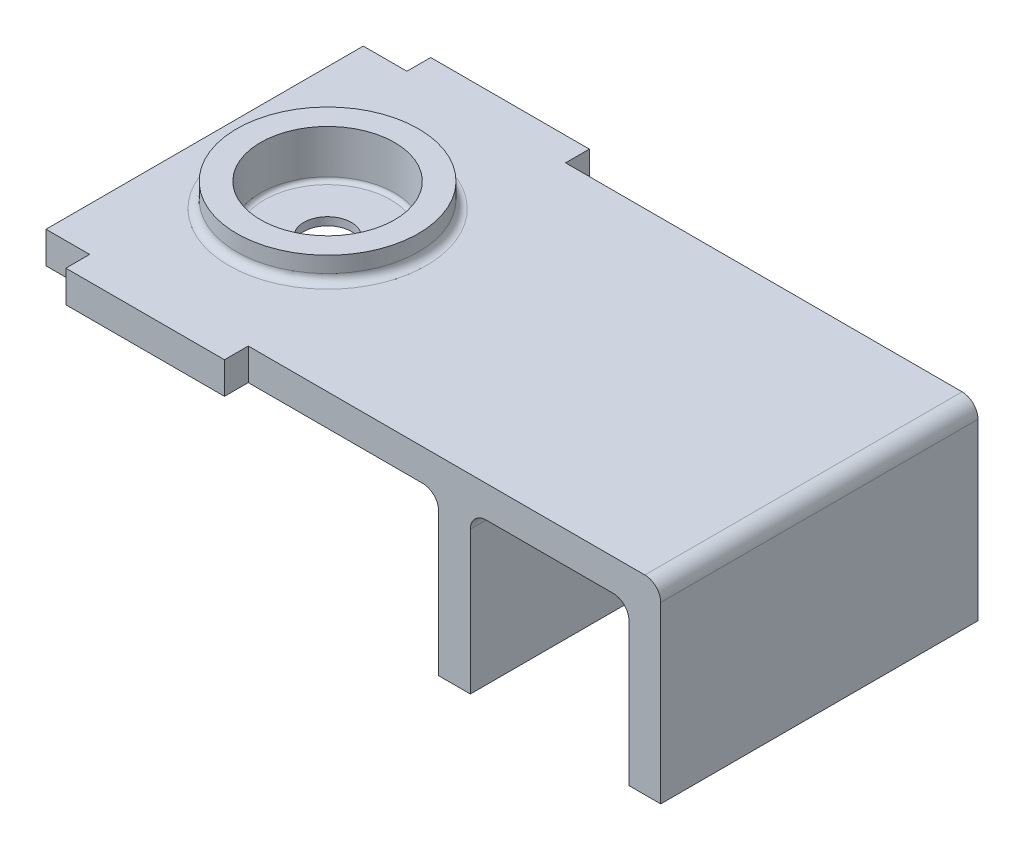
ISO-10303-21;
HEADER;
FILE_DESCRIPTION(('STEP AP214'),'2;1');
FILE_NAME('part.step','',(''),(''),'','','');
FILE_SCHEMA(('AUTOMOTIVE_DESIGN { 1 0 10303 214 1 1 1 1 }'));
ENDSEC;
DATA;
#1=APPLICATION_CONTEXT('core data for automotive mechanical design processes');
#2=APPLICATION_PROTOCOL_DEFINITION('international standard','automotive_design',2000,#1);
#3=PRODUCT_CONTEXT('',#1,'mechanical');
#4=PRODUCT('Part','Part','',(#3));
#5=PRODUCT_RELATED_PRODUCT_CATEGORY('part','',(#4));
#6=PRODUCT_DEFINITION_FORMATION('','',#4);
#7=PRODUCT_DEFINITION_CONTEXT('part definition',#1,'design');
#8=PRODUCT_DEFINITION('design','',#6,#7);
#9=PRODUCT_DEFINITION_SHAPE('','',#8);
#10=(LENGTH_UNIT() NAMED_UNIT(*) SI_UNIT(.MILLI.,.METRE.));
#11=(NAMED_UNIT(*) PLANE_ANGLE_UNIT() SI_UNIT($,.RADIAN.));
#12=(NAMED_UNIT(*) SI_UNIT($,.STERADIAN.) SOLID_ANGLE_UNIT());
#13=UNCERTAINTY_MEASURE_WITH_UNIT(LENGTH_MEASURE(1.E-05),#10,'distance_accuracy_value','');
#14=(GEOMETRIC_REPRESENTATION_CONTEXT(3) GLOBAL_UNCERTAINTY_ASSIGNED_CONTEXT((#13)) GLOBAL_UNIT_ASSIGNED_CONTEXT((#10,
#11,#12)) REPRESENTATION_CONTEXT('',''));
#15=CARTESIAN_POINT('',(0.,0.,0.));
#16=DIRECTION('',(0.,0.,1.));
#17=DIRECTION('',(1.,0.,0.));
#18=AXIS2_PLACEMENT_3D('',#15,#16,#17);
#19=CARTESIAN_POINT('',(0.,11.,20.));
#20=DIRECTION('',(0.,0.,1.));
#21=DIRECTION('',(1.,0.,0.));
#22=AXIS2_PLACEMENT_3D('',#19,#20,#21);
#23=PLANE('',#22);
#24=DIRECTION('',(0.,1.,0.));
#25=VECTOR('',#24,1.);
#26=CARTESIAN_POINT('',(-58.,11.,20.));
#27=LINE('',#26,#25);
#28=CARTESIAN_POINT('',(-58.,10.,20.));
#29=VERTEX_POINT('',#28);
#30=CARTESIAN_POINT('',(-58.,14.,20.));
#31=VERTEX_POINT('',#30);
#32=EDGE_CURVE('E226',#29,#31,#27,.T.);
#33=ORIENTED_EDGE('',*,*,#32,.F.);
#34=DIRECTION('',(-1.,0.,0.));
#35=VECTOR('',#34,1.);
#36=CARTESIAN_POINT('',(0.,10.,20.));
#37=LINE('',#36,#35);
#38=CARTESIAN_POINT('',(-63.5,10.,20.));
#39=VERTEX_POINT('',#38);
#40=EDGE_CURVE('E371',#29,#39,#37,.T.);
#41=ORIENTED_EDGE('',*,*,#40,.T.);
#42=DIRECTION('',(0.,-1.,0.));
#43=VECTOR('',#42,1.);
#44=CARTESIAN_POINT('',(-63.5,11.,20.));
#45=LINE('',#44,#43);
#46=CARTESIAN_POINT('',(-63.5,14.,20.));
#47=VERTEX_POINT('',#46);
#48=EDGE_CURVE('E384',#47,#39,#45,.T.);
#49=ORIENTED_EDGE('',*,*,#48,.F.);
#50=DIRECTION('',(1.,0.,0.));
#51=VECTOR('',#50,1.);
#52=CARTESIAN_POINT('',(0.,14.,20.));
#53=LINE('',#52,#51);
#54=EDGE_CURVE('E348',#47,#31,#53,.T.);
#55=ORIENTED_EDGE('',*,*,#54,.T.);
#56=EDGE_LOOP('',(#33,#41,#49,#55));
#57=FACE_BOUND('',#56,.T.);
#58=ADVANCED_FACE('F42',(#57),#23,.F.);
#59=CARTESIAN_POINT('',(-38.,14.,20.));
#60=VERTEX_POINT('',#59);
#61=CARTESIAN_POINT('',(12.,14.,20.));
#62=VERTEX_POINT('',#61);
#63=EDGE_CURVE('E347',#60,#62,#53,.T.);
#64=ORIENTED_EDGE('',*,*,#63,.T.);
#65=CARTESIAN_POINT('',(12.,12.,20.));
#66=DIRECTION('',(0.,0.,1.));
#67=DIRECTION('',(1.,0.,0.));
#68=AXIS2_PLACEMENT_3D('',#65,#66,#67);
#69=CIRCLE('',#68,2.);
#70=CARTESIAN_POINT('',(14.,12.,20.));
#71=VERTEX_POINT('',#70);
#72=EDGE_CURVE('E443',#62,#71,#69,.F.);
#73=ORIENTED_EDGE('',*,*,#72,.T.);
#74=DIRECTION('',(0.,1.,0.));
#75=VECTOR('',#74,1.);
#76=CARTESIAN_POINT('',(14.,-50.1995024844836,20.));
#77=LINE('',#76,#75);
#78=CARTESIAN_POINT('',(14.,-9.99999999999999,20.));
#79=VERTEX_POINT('',#78);
#80=EDGE_CURVE('E298',#79,#71,#77,.T.);
#81=ORIENTED_EDGE('',*,*,#80,.F.);
#82=DIRECTION('',(-1.,0.,0.));
#83=VECTOR('',#82,1.);
#84=CARTESIAN_POINT('',(0.,-9.99999999999999,20.));
#85=LINE('',#84,#83);
#86=CARTESIAN_POINT('',(10.,-9.99999999999999,20.));
#87=VERTEX_POINT('',#86);
#88=EDGE_CURVE('E277',#79,#87,#85,.T.);
#89=ORIENTED_EDGE('',*,*,#88,.T.);
#90=DIRECTION('',(0.,1.,0.));
#91=VECTOR('',#90,1.);
#92=CARTESIAN_POINT('',(10.,-50.1995024844836,20.));
#93=LINE('',#92,#91);
#94=CARTESIAN_POINT('',(10.,8.,20.));
#95=VERTEX_POINT('',#94);
#96=EDGE_CURVE('E294',#87,#95,#93,.T.);
#97=ORIENTED_EDGE('',*,*,#96,.T.);
#98=CARTESIAN_POINT('',(8.00000000000001,8.,20.));
#99=DIRECTION('',(0.,0.,1.));
#100=DIRECTION('',(1.,0.,0.));
#101=AXIS2_PLACEMENT_3D('',#98,#99,#100);
#102=CIRCLE('',#101,2.);
#103=CARTESIAN_POINT('',(8.00000000000001,10.,20.));
#104=VERTEX_POINT('',#103);
#105=EDGE_CURVE('E429',#95,#104,#102,.T.);
#106=ORIENTED_EDGE('',*,*,#105,.T.);
#107=CARTESIAN_POINT('',(-7.99999999999999,10.,20.));
#108=VERTEX_POINT('',#107);
#109=EDGE_CURVE('E373',#104,#108,#37,.T.);
#110=ORIENTED_EDGE('',*,*,#109,.T.);
#111=CARTESIAN_POINT('',(-7.99999999999999,8.,20.));
#112=DIRECTION('',(0.,0.,1.));
#113=DIRECTION('',(1.,0.,0.));
#114=AXIS2_PLACEMENT_3D('',#111,#112,#113);
#115=CIRCLE('',#114,2.);
#116=CARTESIAN_POINT('',(-9.99999999999999,8.,20.));
#117=VERTEX_POINT('',#116);
#118=EDGE_CURVE('E426',#108,#117,#115,.T.);
#119=ORIENTED_EDGE('',*,*,#118,.T.);
#120=DIRECTION('',(0.,1.,0.));
#121=VECTOR('',#120,1.);
#122=CARTESIAN_POINT('',(-9.99999999999999,-50.1995024844836,20.));
#123=LINE('',#122,#121);
#124=CARTESIAN_POINT('',(-9.99999999999999,-9.99999999999999,20.));
#125=VERTEX_POINT('',#124);
#126=EDGE_CURVE('E289',#125,#117,#123,.T.);
#127=ORIENTED_EDGE('',*,*,#126,.F.);
#128=DIRECTION('',(1.,0.,0.));
#129=VECTOR('',#128,1.);
#130=CARTESIAN_POINT('',(0.,-9.99999999999999,20.));
#131=LINE('',#130,#129);
#132=CARTESIAN_POINT('',(-14.,-9.99999999999999,20.));
#133=VERTEX_POINT('',#132);
#134=EDGE_CURVE('E318',#133,#125,#131,.T.);
#135=ORIENTED_EDGE('',*,*,#134,.F.);
#136=DIRECTION('',(0.,1.,0.));
#137=VECTOR('',#136,1.);
#138=CARTESIAN_POINT('',(-14.,-50.1995024844836,20.));
#139=LINE('',#138,#137);
#140=CARTESIAN_POINT('',(-14.,8.,20.));
#141=VERTEX_POINT('',#140);
#142=EDGE_CURVE('E322',#133,#141,#139,.T.);
#143=ORIENTED_EDGE('',*,*,#142,.T.);
#144=CARTESIAN_POINT('',(-16.,8.,20.));
#145=DIRECTION('',(0.,0.,1.));
#146=DIRECTION('',(1.,0.,0.));
#147=AXIS2_PLACEMENT_3D('',#144,#145,#146);
#148=CIRCLE('',#147,2.);
#149=CARTESIAN_POINT('',(-16.,10.,20.));
#150=VERTEX_POINT('',#149);
#151=EDGE_CURVE('E420',#141,#150,#148,.T.);
#152=ORIENTED_EDGE('',*,*,#151,.T.);
#153=CARTESIAN_POINT('',(-38.,10.,20.));
#154=VERTEX_POINT('',#153);
#155=EDGE_CURVE('E377',#150,#154,#37,.T.);
#156=ORIENTED_EDGE('',*,*,#155,.T.);
#157=DIRECTION('',(0.,-1.,0.));
#158=VECTOR('',#157,1.);
#159=CARTESIAN_POINT('',(-38.,11.,20.));
#160=LINE('',#159,#158);
#161=EDGE_CURVE('E211',#60,#154,#160,.T.);
#162=ORIENTED_EDGE('',*,*,#161,.F.);
#163=EDGE_LOOP('',(#64,#73,#81,#89,#97,#106,#110,#119,#127,#135,#143,#152,#156,#162));
#164=FACE_BOUND('',#163,.T.);
#165=ADVANCED_FACE('F462',(#164),#23,.F.);
#166=CARTESIAN_POINT('',(0.,11.,60.));
#167=DIRECTION('',(0.,0.,1.));
#168=DIRECTION('',(1.,0.,0.));
#169=AXIS2_PLACEMENT_3D('',#166,#167,#168);
#170=PLANE('',#169);
#171=DIRECTION('',(0.,1.,0.));
#172=VECTOR('',#171,1.);
#173=CARTESIAN_POINT('',(14.,-50.1995024844836,60.));
#174=LINE('',#173,#172);
#175=CARTESIAN_POINT('',(14.,-9.99999999999999,60.));
#176=VERTEX_POINT('',#175);
#177=CARTESIAN_POINT('',(14.,12.,60.));
#178=VERTEX_POINT('',#177);
#179=EDGE_CURVE('E267',#176,#178,#174,.T.);
#180=ORIENTED_EDGE('',*,*,#179,.T.);
#181=CARTESIAN_POINT('',(12.,12.,60.));
#182=DIRECTION('',(0.,0.,1.));
#183=DIRECTION('',(1.,0.,0.));
#184=AXIS2_PLACEMENT_3D('',#181,#182,#183);
#185=CIRCLE('',#184,2.);
#186=CARTESIAN_POINT('',(12.,14.,60.));
#187=VERTEX_POINT('',#186);
#188=EDGE_CURVE('E66',#178,#187,#185,.T.);
#189=ORIENTED_EDGE('',*,*,#188,.T.);
#190=DIRECTION('',(1.,0.,0.));
#191=VECTOR('',#190,1.);
#192=CARTESIAN_POINT('',(0.,14.,60.));
#193=LINE('',#192,#191);
#194=CARTESIAN_POINT('',(-38.,14.,60.));
#195=VERTEX_POINT('',#194);
#196=EDGE_CURVE('E351',#195,#187,#193,.T.);
#197=ORIENTED_EDGE('',*,*,#196,.F.);
#198=DIRECTION('',(0.,-1.,0.));
#199=VECTOR('',#198,1.);
#200=CARTESIAN_POINT('',(-38.,0.,60.));
#201=LINE('',#200,#199);
#202=CARTESIAN_POINT('',(-38.,10.,60.));
#203=VERTEX_POINT('',#202);
#204=EDGE_CURVE('E245',#195,#203,#201,.T.);
#205=ORIENTED_EDGE('',*,*,#204,.T.);
#206=DIRECTION('',(-1.,0.,0.));
#207=VECTOR('',#206,1.);
#208=CARTESIAN_POINT('',(0.,10.,60.));
#209=LINE('',#208,#207);
#210=CARTESIAN_POINT('',(-16.,10.,60.));
#211=VERTEX_POINT('',#210);
#212=EDGE_CURVE('E372',#211,#203,#209,.T.);
#213=ORIENTED_EDGE('',*,*,#212,.F.);
#214=CARTESIAN_POINT('',(-16.,8.,60.));
#215=DIRECTION('',(0.,0.,1.));
#216=DIRECTION('',(1.,0.,0.));
#217=AXIS2_PLACEMENT_3D('',#214,#215,#216);
#218=CIRCLE('',#217,2.);
#219=CARTESIAN_POINT('',(-14.,8.,60.));
#220=VERTEX_POINT('',#219);
#221=EDGE_CURVE('E417',#211,#220,#218,.F.);
#222=ORIENTED_EDGE('',*,*,#221,.T.);
#223=DIRECTION('',(0.,1.,0.));
#224=VECTOR('',#223,1.);
#225=CARTESIAN_POINT('',(-14.,-50.1995024844836,60.));
#226=LINE('',#225,#224);
#227=CARTESIAN_POINT('',(-14.,-9.99999999999999,60.));
#228=VERTEX_POINT('',#227);
#229=EDGE_CURVE('E326',#228,#220,#226,.T.);
#230=ORIENTED_EDGE('',*,*,#229,.F.);
#231=DIRECTION('',(-1.,0.,0.));
#232=VECTOR('',#231,1.);
#233=CARTESIAN_POINT('',(0.,-9.99999999999999,60.));
#234=LINE('',#233,#232);
#235=CARTESIAN_POINT('',(-9.99999999999999,-9.99999999999999,60.));
#236=VERTEX_POINT('',#235);
#237=EDGE_CURVE('E310',#236,#228,#234,.T.);
#238=ORIENTED_EDGE('',*,*,#237,.F.);
#239=DIRECTION('',(0.,1.,0.));
#240=VECTOR('',#239,1.);
#241=CARTESIAN_POINT('',(-9.99999999999999,-50.1995024844836,60.));
#242=LINE('',#241,#240);
#243=CARTESIAN_POINT('',(-9.99999999999999,8.,60.));
#244=VERTEX_POINT('',#243);
#245=EDGE_CURVE('E311',#236,#244,#242,.T.);
#246=ORIENTED_EDGE('',*,*,#245,.T.);
#247=CARTESIAN_POINT('',(-7.99999999999999,8.,60.));
#248=DIRECTION('',(0.,0.,1.));
#249=DIRECTION('',(1.,0.,0.));
#250=AXIS2_PLACEMENT_3D('',#247,#248,#249);
#251=CIRCLE('',#250,2.);
#252=CARTESIAN_POINT('',(-7.99999999999999,10.,60.));
#253=VERTEX_POINT('',#252);
#254=EDGE_CURVE('E423',#244,#253,#251,.F.);
#255=ORIENTED_EDGE('',*,*,#254,.T.);
#256=CARTESIAN_POINT('',(8.00000000000001,10.,60.));
#257=VERTEX_POINT('',#256);
#258=EDGE_CURVE('E367',#257,#253,#209,.T.);
#259=ORIENTED_EDGE('',*,*,#258,.F.);
#260=CARTESIAN_POINT('',(8.00000000000001,8.,60.));
#261=DIRECTION('',(0.,0.,1.));
#262=DIRECTION('',(1.,0.,0.));
#263=AXIS2_PLACEMENT_3D('',#260,#261,#262);
#264=CIRCLE('',#263,2.);
#265=CARTESIAN_POINT('',(10.,8.,60.));
#266=VERTEX_POINT('',#265);
#267=EDGE_CURVE('E432',#257,#266,#264,.F.);
#268=ORIENTED_EDGE('',*,*,#267,.T.);
#269=DIRECTION('',(0.,1.,0.));
#270=VECTOR('',#269,1.);
#271=CARTESIAN_POINT('',(10.,-50.1995024844836,60.));
#272=LINE('',#271,#270);
#273=CARTESIAN_POINT('',(10.,-9.99999999999999,60.));
#274=VERTEX_POINT('',#273);
#275=EDGE_CURVE('E290',#274,#266,#272,.T.);
#276=ORIENTED_EDGE('',*,*,#275,.F.);
#277=DIRECTION('',(-1.,0.,0.));
#278=VECTOR('',#277,1.);
#279=CARTESIAN_POINT('',(0.,-9.99999999999999,60.));
#280=LINE('',#279,#278);
#281=EDGE_CURVE('E286',#176,#274,#280,.T.);
#282=ORIENTED_EDGE('',*,*,#281,.F.);
#283=EDGE_LOOP('',(#180,#189,#197,#205,#213,#222,#230,#238,#246,#255,#259,#268,#276,#282));
#284=FACE_BOUND('',#283,.T.);
#285=ADVANCED_FACE('F468',(#284),#170,.T.);
#286=CARTESIAN_POINT('',(-58.,10.,60.));
#287=VERTEX_POINT('',#286);
#288=CARTESIAN_POINT('',(-63.5,10.,60.));
#289=VERTEX_POINT('',#288);
#290=EDGE_CURVE('E366',#287,#289,#209,.T.);
#291=ORIENTED_EDGE('',*,*,#290,.F.);
#292=DIRECTION('',(0.,1.,0.));
#293=VECTOR('',#292,1.);
#294=CARTESIAN_POINT('',(-58.,0.,60.));
#295=LINE('',#294,#293);
#296=CARTESIAN_POINT('',(-58.,14.,60.));
#297=VERTEX_POINT('',#296);
#298=EDGE_CURVE('E240',#287,#297,#295,.T.);
#299=ORIENTED_EDGE('',*,*,#298,.T.);
#300=CARTESIAN_POINT('',(-63.5,14.,60.));
#301=VERTEX_POINT('',#300);
#302=EDGE_CURVE('E352',#301,#297,#193,.T.);
#303=ORIENTED_EDGE('',*,*,#302,.F.);
#304=DIRECTION('',(0.,-1.,0.));
#305=VECTOR('',#304,1.);
#306=CARTESIAN_POINT('',(-63.5,11.,60.));
#307=LINE('',#306,#305);
#308=EDGE_CURVE('E361',#301,#289,#307,.T.);
#309=ORIENTED_EDGE('',*,*,#308,.T.);
#310=EDGE_LOOP('',(#291,#299,#303,#309));
#311=FACE_BOUND('',#310,.T.);
#312=ADVANCED_FACE('F476',(#311),#170,.T.);
#313=CARTESIAN_POINT('',(0.,10.,0.));
#314=DIRECTION('',(0.,1.,0.));
#315=DIRECTION('',(0.,0.,1.));
#316=AXIS2_PLACEMENT_3D('',#313,#314,#315);
#317=PLANE('',#316);
#318=ORIENTED_EDGE('',*,*,#258,.T.);
#319=DIRECTION('',(0.,0.,1.));
#320=VECTOR('',#319,1.);
#321=CARTESIAN_POINT('',(-7.99999999999999,10.,20.));
#322=LINE('',#321,#320);
#323=EDGE_CURVE('E410',#253,#108,#322,.F.);
#324=ORIENTED_EDGE('',*,*,#323,.T.);
#325=ORIENTED_EDGE('',*,*,#109,.F.);
#326=DIRECTION('',(0.,0.,-1.));
#327=VECTOR('',#326,1.);
#328=CARTESIAN_POINT('',(8.00000000000001,10.,60.));
#329=LINE('',#328,#327);
#330=EDGE_CURVE('E407',#104,#257,#329,.F.);
#331=ORIENTED_EDGE('',*,*,#330,.T.);
#332=EDGE_LOOP('',(#318,#324,#325,#331));
#333=FACE_BOUND('',#332,.T.);
#334=ADVANCED_FACE('F547',(#333),#317,.F.);
#335=CARTESIAN_POINT('',(0.,11.,0.));
#336=DIRECTION('',(0.,1.,0.));
#337=DIRECTION('',(0.,0.,1.));
#338=AXIS2_PLACEMENT_3D('',#335,#336,#337);
#339=PLANE('',#338);
#340=CARTESIAN_POINT('',(-48.,11.,40.));
#341=DIRECTION('',(0.,1.,0.));
#342=DIRECTION('',(0.,0.,1.));
#343=AXIS2_PLACEMENT_3D('',#340,#341,#342);
#344=CIRCLE('',#343,7.95);
#345=CARTESIAN_POINT('',(-48.,11.,47.95));
#346=VERTEX_POINT('',#345);
#347=EDGE_CURVE('E51',#346,#346,#344,.T.);
#348=ORIENTED_EDGE('',*,*,#347,.T.);
#349=EDGE_LOOP('',(#348));
#350=FACE_BOUND('',#349,.T.);
#351=CARTESIAN_POINT('',(-48.,11.,40.));
#352=DIRECTION('',(0.,1.,0.));
#353=DIRECTION('',(0.,0.,1.));
#354=AXIS2_PLACEMENT_3D('',#351,#352,#353);
#355=CIRCLE('',#354,3.);
#356=CARTESIAN_POINT('',(-48.,11.,43.));
#357=VERTEX_POINT('',#356);
#358=EDGE_CURVE('E357',#357,#357,#355,.T.);
#359=ORIENTED_EDGE('',*,*,#358,.F.);
#360=EDGE_LOOP('',(#359));
#361=FACE_BOUND('',#360,.T.);
#362=ADVANCED_FACE('F449',(#350,#361),#339,.T.);
#363=CARTESIAN_POINT('',(-48.,11.,40.));
#364=DIRECTION('',(0.,-1.,0.));
#365=DIRECTION('',(0.,0.,-1.));
#366=AXIS2_PLACEMENT_3D('',#363,#364,#365);
#367=CYLINDRICAL_SURFACE('',#366,3.);
#368=ORIENTED_EDGE('',*,*,#358,.T.);
#369=EDGE_LOOP('',(#368));
#370=FACE_BOUND('',#369,.T.);
#371=CARTESIAN_POINT('',(-48.,10.,40.));
#372=DIRECTION('',(0.,1.,0.));
#373=DIRECTION('',(0.,0.,1.));
#374=AXIS2_PLACEMENT_3D('',#371,#372,#373);
#375=CIRCLE('',#374,3.);
#376=CARTESIAN_POINT('',(-48.,10.,43.));
#377=VERTEX_POINT('',#376);
#378=EDGE_CURVE('E356',#377,#377,#375,.T.);
#379=ORIENTED_EDGE('',*,*,#378,.F.);
#380=EDGE_LOOP('',(#379));
#381=FACE_BOUND('',#380,.T.);
#382=ADVANCED_FACE('F477',(#370,#381),#367,.F.);
#383=CARTESIAN_POINT('',(-63.5,11.,0.));
#384=DIRECTION('',(1.,0.,0.));
#385=DIRECTION('',(0.,0.,-1.));
#386=AXIS2_PLACEMENT_3D('',#383,#384,#385);
#387=PLANE('',#386);
#388=DIRECTION('',(0.,0.,1.));
#389=VECTOR('',#388,1.);
#390=CARTESIAN_POINT('',(-63.5,10.,0.));
#391=LINE('',#390,#389);
#392=EDGE_CURVE('E362',#39,#289,#391,.T.);
#393=ORIENTED_EDGE('',*,*,#392,.T.);
#394=ORIENTED_EDGE('',*,*,#308,.F.);
#395=DIRECTION('',(0.,0.,-1.));
#396=VECTOR('',#395,1.);
#397=CARTESIAN_POINT('',(-63.5,14.,0.));
#398=LINE('',#397,#396);
#399=EDGE_CURVE('E343',#301,#47,#398,.T.);
#400=ORIENTED_EDGE('',*,*,#399,.T.);
#401=ORIENTED_EDGE('',*,*,#48,.T.);
#402=EDGE_LOOP('',(#393,#394,#400,#401));
#403=FACE_BOUND('',#402,.T.);
#404=ADVANCED_FACE('F472',(#403),#387,.F.);
#405=ORIENTED_EDGE('',*,*,#378,.T.);
#406=EDGE_LOOP('',(#405));
#407=FACE_BOUND('',#406,.T.);
#408=ORIENTED_EDGE('',*,*,#155,.F.);
#409=DIRECTION('',(0.,0.,1.));
#410=VECTOR('',#409,1.);
#411=CARTESIAN_POINT('',(-16.,10.,0.));
#412=LINE('',#411,#410);
#413=EDGE_CURVE('E396',#150,#211,#412,.T.);
#414=ORIENTED_EDGE('',*,*,#413,.T.);
#415=ORIENTED_EDGE('',*,*,#212,.T.);
#416=DIRECTION('',(0.,0.,-1.));
#417=VECTOR('',#416,1.);
#418=CARTESIAN_POINT('',(-38.,10.,83.3960780543712));
#419=LINE('',#418,#417);
#420=CARTESIAN_POINT('',(-38.,10.,63.));
#421=VERTEX_POINT('',#420);
#422=EDGE_CURVE('E263',#421,#203,#419,.T.);
#423=ORIENTED_EDGE('',*,*,#422,.F.);
#424=DIRECTION('',(1.,0.,0.));
#425=VECTOR('',#424,1.);
#426=CARTESIAN_POINT('',(0.,10.,63.));
#427=LINE('',#426,#425);
#428=CARTESIAN_POINT('',(-58.,10.,63.));
#429=VERTEX_POINT('',#428);
#430=EDGE_CURVE('E258',#429,#421,#427,.T.);
#431=ORIENTED_EDGE('',*,*,#430,.F.);
#432=DIRECTION('',(0.,0.,-1.));
#433=VECTOR('',#432,1.);
#434=CARTESIAN_POINT('',(-58.,10.,83.3960780543712));
#435=LINE('',#434,#433);
#436=EDGE_CURVE('E249',#429,#287,#435,.T.);
#437=ORIENTED_EDGE('',*,*,#436,.T.);
#438=ORIENTED_EDGE('',*,*,#290,.T.);
#439=ORIENTED_EDGE('',*,*,#392,.F.);
#440=ORIENTED_EDGE('',*,*,#40,.F.);
#441=DIRECTION('',(0.,0.,1.));
#442=VECTOR('',#441,1.);
#443=CARTESIAN_POINT('',(-58.,10.,-3.39607805437116));
#444=LINE('',#443,#442);
#445=CARTESIAN_POINT('',(-58.,10.,17.));
#446=VERTEX_POINT('',#445);
#447=EDGE_CURVE('E221',#446,#29,#444,.T.);
#448=ORIENTED_EDGE('',*,*,#447,.F.);
#449=DIRECTION('',(1.,0.,0.));
#450=VECTOR('',#449,1.);
#451=CARTESIAN_POINT('',(0.,10.,17.));
#452=LINE('',#451,#450);
#453=CARTESIAN_POINT('',(-38.,10.,17.));
#454=VERTEX_POINT('',#453);
#455=EDGE_CURVE('E197',#446,#454,#452,.T.);
#456=ORIENTED_EDGE('',*,*,#455,.T.);
#457=DIRECTION('',(0.,0.,1.));
#458=VECTOR('',#457,1.);
#459=CARTESIAN_POINT('',(-38.,10.,-3.39607805437116));
#460=LINE('',#459,#458);
#461=EDGE_CURVE('E209',#454,#154,#460,.T.);
#462=ORIENTED_EDGE('',*,*,#461,.T.);
#463=EDGE_LOOP('',(#408,#414,#415,#423,#431,#437,#438,#439,#440,#448,#456,#462));
#464=FACE_BOUND('',#463,.T.);
#465=ADVANCED_FACE('F218',(#407,#464),#317,.F.);
#466=CARTESIAN_POINT('',(0.,14.,0.));
#467=DIRECTION('',(0.,-1.,0.));
#468=DIRECTION('',(0.,0.,-1.));
#469=AXIS2_PLACEMENT_3D('',#466,#467,#468);
#470=PLANE('',#469);
#471=CARTESIAN_POINT('',(-48.,14.,40.));
#472=DIRECTION('',(0.,-1.,0.));
#473=DIRECTION('',(0.,0.,-1.));
#474=AXIS2_PLACEMENT_3D('',#471,#472,#473);
#475=CIRCLE('',#474,12.45);
#476=CARTESIAN_POINT('',(-48.,14.,27.55));
#477=VERTEX_POINT('',#476);
#478=EDGE_CURVE('E388',#477,#477,#475,.T.);
#479=ORIENTED_EDGE('',*,*,#478,.T.);
#480=EDGE_LOOP('',(#479));
#481=FACE_BOUND('',#480,.T.);
#482=ORIENTED_EDGE('',*,*,#196,.T.);
#483=DIRECTION('',(0.,0.,1.));
#484=VECTOR('',#483,1.);
#485=CARTESIAN_POINT('',(12.,14.,0.));
#486=LINE('',#485,#484);
#487=EDGE_CURVE('E58',#187,#62,#486,.F.);
#488=ORIENTED_EDGE('',*,*,#487,.T.);
#489=ORIENTED_EDGE('',*,*,#63,.F.);
#490=DIRECTION('',(0.,0.,1.));
#491=VECTOR('',#490,1.);
#492=CARTESIAN_POINT('',(-38.,14.,-3.39607805437116));
#493=LINE('',#492,#491);
#494=CARTESIAN_POINT('',(-38.,14.,17.));
#495=VERTEX_POINT('',#494);
#496=EDGE_CURVE('E215',#495,#60,#493,.T.);
#497=ORIENTED_EDGE('',*,*,#496,.F.);
#498=DIRECTION('',(-1.,0.,0.));
#499=VECTOR('',#498,1.);
#500=CARTESIAN_POINT('',(0.,14.,17.));
#501=LINE('',#500,#499);
#502=CARTESIAN_POINT('',(-58.,14.,17.));
#503=VERTEX_POINT('',#502);
#504=EDGE_CURVE('E200',#495,#503,#501,.T.);
#505=ORIENTED_EDGE('',*,*,#504,.T.);
#506=DIRECTION('',(0.,0.,1.));
#507=VECTOR('',#506,1.);
#508=CARTESIAN_POINT('',(-58.,14.,-3.39607805437116));
#509=LINE('',#508,#507);
#510=EDGE_CURVE('E231',#503,#31,#509,.T.);
#511=ORIENTED_EDGE('',*,*,#510,.T.);
#512=ORIENTED_EDGE('',*,*,#54,.F.);
#513=ORIENTED_EDGE('',*,*,#399,.F.);
#514=ORIENTED_EDGE('',*,*,#302,.T.);
#515=DIRECTION('',(0.,0.,-1.));
#516=VECTOR('',#515,1.);
#517=CARTESIAN_POINT('',(-58.,14.,83.3960780543712));
#518=LINE('',#517,#516);
#519=CARTESIAN_POINT('',(-58.,14.,63.));
#520=VERTEX_POINT('',#519);
#521=EDGE_CURVE('E253',#520,#297,#518,.T.);
#522=ORIENTED_EDGE('',*,*,#521,.F.);
#523=DIRECTION('',(-1.,0.,0.));
#524=VECTOR('',#523,1.);
#525=CARTESIAN_POINT('',(0.,14.,63.));
#526=LINE('',#525,#524);
#527=CARTESIAN_POINT('',(-38.,14.,63.));
#528=VERTEX_POINT('',#527);
#529=EDGE_CURVE('E244',#528,#520,#526,.T.);
#530=ORIENTED_EDGE('',*,*,#529,.F.);
#531=DIRECTION('',(0.,0.,-1.));
#532=VECTOR('',#531,1.);
#533=CARTESIAN_POINT('',(-38.,14.,83.3960780543712));
#534=LINE('',#533,#532);
#535=EDGE_CURVE('E254',#528,#195,#534,.T.);
#536=ORIENTED_EDGE('',*,*,#535,.T.);
#537=EDGE_LOOP('',(#482,#488,#489,#497,#505,#511,#512,#513,#514,#522,#530,#536));
#538=FACE_BOUND('',#537,.T.);
#539=ADVANCED_FACE('F557',(#481,#538),#470,.F.);
#540=CARTESIAN_POINT('',(-48.,14.,40.));
#541=DIRECTION('',(0.,-1.,0.));
#542=DIRECTION('',(0.,0.,-1.));
#543=AXIS2_PLACEMENT_3D('',#540,#541,#542);
#544=CYLINDRICAL_SURFACE('',#543,8.45);
#545=CARTESIAN_POINT('',(-48.,11.5,40.));
#546=DIRECTION('',(0.,1.,0.));
#547=DIRECTION('',(0.,0.,1.));
#548=AXIS2_PLACEMENT_3D('',#545,#546,#547);
#549=CIRCLE('',#548,8.45);
#550=CARTESIAN_POINT('',(-48.,11.5,48.45));
#551=VERTEX_POINT('',#550);
#552=EDGE_CURVE('E12',#551,#551,#549,.F.);
#553=ORIENTED_EDGE('',*,*,#552,.T.);
#554=EDGE_LOOP('',(#553));
#555=FACE_BOUND('',#554,.T.);
#556=CARTESIAN_POINT('',(-48.,17.,40.));
#557=DIRECTION('',(0.,-1.,0.));
#558=DIRECTION('',(0.,0.,-1.));
#559=AXIS2_PLACEMENT_3D('',#556,#557,#558);
#560=CIRCLE('',#559,8.45);
#561=CARTESIAN_POINT('',(-48.,17.,31.55));
#562=VERTEX_POINT('',#561);
#563=EDGE_CURVE('E335',#562,#562,#560,.T.);
#564=ORIENTED_EDGE('',*,*,#563,.F.);
#565=EDGE_LOOP('',(#564));
#566=FACE_BOUND('',#565,.T.);
#567=ADVANCED_FACE('F563',(#555,#566),#544,.F.);
#568=CARTESIAN_POINT('',(-48.,17.,40.));
#569=DIRECTION('',(0.,-1.,0.));
#570=DIRECTION('',(0.,0.,-1.));
#571=AXIS2_PLACEMENT_3D('',#568,#569,#570);
#572=CYLINDRICAL_SURFACE('',#571,11.45);
#573=CARTESIAN_POINT('',(-48.,15.,40.));
#574=DIRECTION('',(0.,-1.,0.));
#575=DIRECTION('',(0.,0.,-1.));
#576=AXIS2_PLACEMENT_3D('',#573,#574,#575);
#577=CIRCLE('',#576,11.45);
#578=CARTESIAN_POINT('',(-48.,15.,28.55));
#579=VERTEX_POINT('',#578);
#580=EDGE_CURVE('E392',#579,#579,#577,.F.);
#581=ORIENTED_EDGE('',*,*,#580,.T.);
#582=EDGE_LOOP('',(#581));
#583=FACE_BOUND('',#582,.T.);
#584=CARTESIAN_POINT('',(-48.,17.,40.));
#585=DIRECTION('',(0.,-1.,0.));
#586=DIRECTION('',(0.,0.,-1.));
#587=AXIS2_PLACEMENT_3D('',#584,#585,#586);
#588=CIRCLE('',#587,11.45);
#589=CARTESIAN_POINT('',(-48.,17.,28.55));
#590=VERTEX_POINT('',#589);
#591=EDGE_CURVE('E339',#590,#590,#588,.T.);
#592=ORIENTED_EDGE('',*,*,#591,.T.);
#593=EDGE_LOOP('',(#592));
#594=FACE_BOUND('',#593,.T.);
#595=ADVANCED_FACE('F614',(#583,#594),#572,.T.);
#596=CARTESIAN_POINT('',(-48.,17.,40.));
#597=DIRECTION('',(0.,-1.,0.));
#598=DIRECTION('',(0.,0.,-1.));
#599=AXIS2_PLACEMENT_3D('',#596,#597,#598);
#600=PLANE('',#599);
#601=ORIENTED_EDGE('',*,*,#563,.T.);
#602=EDGE_LOOP('',(#601));
#603=FACE_BOUND('',#602,.T.);
#604=ORIENTED_EDGE('',*,*,#591,.F.);
#605=EDGE_LOOP('',(#604));
#606=FACE_BOUND('',#605,.T.);
#607=ADVANCED_FACE('F611',(#603,#606),#600,.F.);
#608=CARTESIAN_POINT('',(-9.99999999999999,-50.1995024844836,0.));
#609=DIRECTION('',(-1.,0.,0.));
#610=DIRECTION('',(0.,0.,1.));
#611=AXIS2_PLACEMENT_3D('',#608,#609,#610);
#612=PLANE('',#611);
#613=ORIENTED_EDGE('',*,*,#126,.T.);
#614=DIRECTION('',(0.,0.,1.));
#615=VECTOR('',#614,1.);
#616=CARTESIAN_POINT('',(-9.99999999999999,8.,60.));
#617=LINE('',#616,#615);
#618=EDGE_CURVE('E403',#117,#244,#617,.T.);
#619=ORIENTED_EDGE('',*,*,#618,.T.);
#620=ORIENTED_EDGE('',*,*,#245,.F.);
#621=DIRECTION('',(0.,0.,-1.));
#622=VECTOR('',#621,1.);
#623=CARTESIAN_POINT('',(-9.99999999999999,-9.99999999999999,0.));
#624=LINE('',#623,#622);
#625=EDGE_CURVE('E314',#236,#125,#624,.T.);
#626=ORIENTED_EDGE('',*,*,#625,.T.);
#627=EDGE_LOOP('',(#613,#619,#620,#626));
#628=FACE_BOUND('',#627,.T.);
#629=ADVANCED_FACE('F541',(#628),#612,.F.);
#630=CARTESIAN_POINT('',(-14.,-50.1995024844836,0.));
#631=DIRECTION('',(-1.,0.,0.));
#632=DIRECTION('',(0.,0.,1.));
#633=AXIS2_PLACEMENT_3D('',#630,#631,#632);
#634=PLANE('',#633);
#635=ORIENTED_EDGE('',*,*,#229,.T.);
#636=DIRECTION('',(0.,0.,1.));
#637=VECTOR('',#636,1.);
#638=CARTESIAN_POINT('',(-14.,8.,0.));
#639=LINE('',#638,#637);
#640=EDGE_CURVE('E400',#220,#141,#639,.F.);
#641=ORIENTED_EDGE('',*,*,#640,.T.);
#642=ORIENTED_EDGE('',*,*,#142,.F.);
#643=DIRECTION('',(0.,0.,-1.));
#644=VECTOR('',#643,1.);
#645=CARTESIAN_POINT('',(-14.,-9.99999999999999,0.));
#646=LINE('',#645,#644);
#647=EDGE_CURVE('E307',#228,#133,#646,.T.);
#648=ORIENTED_EDGE('',*,*,#647,.F.);
#649=EDGE_LOOP('',(#635,#641,#642,#648));
#650=FACE_BOUND('',#649,.T.);
#651=ADVANCED_FACE('F534',(#650),#634,.T.);
#652=CARTESIAN_POINT('',(-9.99999999999999,-10.,2000.));
#653=DIRECTION('',(0.,1.,0.));
#654=DIRECTION('',(0.,0.,1.));
#655=AXIS2_PLACEMENT_3D('',#652,#653,#654);
#656=PLANE('',#655);
#657=ORIENTED_EDGE('',*,*,#237,.T.);
#658=ORIENTED_EDGE('',*,*,#647,.T.);
#659=ORIENTED_EDGE('',*,*,#134,.T.);
#660=ORIENTED_EDGE('',*,*,#625,.F.);
#661=EDGE_LOOP('',(#657,#658,#659,#660));
#662=FACE_BOUND('',#661,.T.);
#663=ADVANCED_FACE('F538',(#662),#656,.F.);
#664=CARTESIAN_POINT('',(10.,-50.1995024844836,0.));
#665=DIRECTION('',(1.,0.,0.));
#666=DIRECTION('',(0.,0.,-1.));
#667=AXIS2_PLACEMENT_3D('',#664,#665,#666);
#668=PLANE('',#667);
#669=ORIENTED_EDGE('',*,*,#275,.T.);
#670=DIRECTION('',(0.,0.,-1.));
#671=VECTOR('',#670,1.);
#672=CARTESIAN_POINT('',(10.,8.,20.));
#673=LINE('',#672,#671);
#674=EDGE_CURVE('E413',#266,#95,#673,.T.);
#675=ORIENTED_EDGE('',*,*,#674,.T.);
#676=ORIENTED_EDGE('',*,*,#96,.F.);
#677=DIRECTION('',(0.,0.,1.));
#678=VECTOR('',#677,1.);
#679=CARTESIAN_POINT('',(10.,-9.99999999999999,0.));
#680=LINE('',#679,#678);
#681=EDGE_CURVE('E281',#87,#274,#680,.T.);
#682=ORIENTED_EDGE('',*,*,#681,.T.);
#683=EDGE_LOOP('',(#669,#675,#676,#682));
#684=FACE_BOUND('',#683,.T.);
#685=ADVANCED_FACE('F505',(#684),#668,.F.);
#686=CARTESIAN_POINT('',(14.,-50.1995024844836,0.));
#687=DIRECTION('',(-1.,0.,0.));
#688=DIRECTION('',(0.,0.,1.));
#689=AXIS2_PLACEMENT_3D('',#686,#687,#688);
#690=PLANE('',#689);
#691=ORIENTED_EDGE('',*,*,#80,.T.);
#692=DIRECTION('',(0.,0.,1.));
#693=VECTOR('',#692,1.);
#694=CARTESIAN_POINT('',(14.,12.,0.));
#695=LINE('',#694,#693);
#696=EDGE_CURVE('E435',#71,#178,#695,.T.);
#697=ORIENTED_EDGE('',*,*,#696,.T.);
#698=ORIENTED_EDGE('',*,*,#179,.F.);
#699=DIRECTION('',(0.,0.,-1.));
#700=VECTOR('',#699,1.);
#701=CARTESIAN_POINT('',(14.,-9.99999999999999,0.));
#702=LINE('',#701,#700);
#703=EDGE_CURVE('E282',#176,#79,#702,.T.);
#704=ORIENTED_EDGE('',*,*,#703,.T.);
#705=EDGE_LOOP('',(#691,#697,#698,#704));
#706=FACE_BOUND('',#705,.T.);
#707=ADVANCED_FACE('F512',(#706),#690,.F.);
#708=CARTESIAN_POINT('',(-9.99999999999999,-10.,2000.));
#709=DIRECTION('',(0.,1.,0.));
#710=DIRECTION('',(0.,0.,1.));
#711=AXIS2_PLACEMENT_3D('',#708,#709,#710);
#712=PLANE('',#711);
#713=ORIENTED_EDGE('',*,*,#281,.T.);
#714=ORIENTED_EDGE('',*,*,#681,.F.);
#715=ORIENTED_EDGE('',*,*,#88,.F.);
#716=ORIENTED_EDGE('',*,*,#703,.F.);
#717=EDGE_LOOP('',(#713,#714,#715,#716));
#718=FACE_BOUND('',#717,.T.);
#719=ADVANCED_FACE('F508',(#718),#712,.F.);
#720=CARTESIAN_POINT('',(-38.,0.,83.3960780543712));
#721=DIRECTION('',(1.,0.,0.));
#722=DIRECTION('',(0.,0.,-1.));
#723=AXIS2_PLACEMENT_3D('',#720,#721,#722);
#724=PLANE('',#723);
#725=ORIENTED_EDGE('',*,*,#535,.F.);
#726=DIRECTION('',(0.,-1.,0.));
#727=VECTOR('',#726,1.);
#728=CARTESIAN_POINT('',(-38.,0.,63.));
#729=LINE('',#728,#727);
#730=EDGE_CURVE('E259',#528,#421,#729,.T.);
#731=ORIENTED_EDGE('',*,*,#730,.T.);
#732=ORIENTED_EDGE('',*,*,#422,.T.);
#733=ORIENTED_EDGE('',*,*,#204,.F.);
#734=EDGE_LOOP('',(#725,#731,#732,#733));
#735=FACE_BOUND('',#734,.T.);
#736=ADVANCED_FACE('F586',(#735),#724,.T.);
#737=CARTESIAN_POINT('',(-58.,0.,83.3960780543712));
#738=DIRECTION('',(-1.,0.,0.));
#739=DIRECTION('',(0.,0.,1.));
#740=AXIS2_PLACEMENT_3D('',#737,#738,#739);
#741=PLANE('',#740);
#742=ORIENTED_EDGE('',*,*,#436,.F.);
#743=DIRECTION('',(0.,1.,0.));
#744=VECTOR('',#743,1.);
#745=CARTESIAN_POINT('',(-58.,0.,63.));
#746=LINE('',#745,#744);
#747=EDGE_CURVE('E250',#429,#520,#746,.T.);
#748=ORIENTED_EDGE('',*,*,#747,.T.);
#749=ORIENTED_EDGE('',*,*,#521,.T.);
#750=ORIENTED_EDGE('',*,*,#298,.F.);
#751=EDGE_LOOP('',(#742,#748,#749,#750));
#752=FACE_BOUND('',#751,.T.);
#753=ADVANCED_FACE('F577',(#752),#741,.T.);
#754=CARTESIAN_POINT('',(-58.,0.,63.));
#755=DIRECTION('',(0.,0.,1.));
#756=DIRECTION('',(1.,0.,0.));
#757=AXIS2_PLACEMENT_3D('',#754,#755,#756);
#758=PLANE('',#757);
#759=ORIENTED_EDGE('',*,*,#730,.F.);
#760=ORIENTED_EDGE('',*,*,#529,.T.);
#761=ORIENTED_EDGE('',*,*,#747,.F.);
#762=ORIENTED_EDGE('',*,*,#430,.T.);
#763=EDGE_LOOP('',(#759,#760,#761,#762));
#764=FACE_BOUND('',#763,.T.);
#765=ADVANCED_FACE('F582',(#764),#758,.T.);
#766=CARTESIAN_POINT('',(-58.,0.,17.));
#767=DIRECTION('',(0.,0.,-1.));
#768=DIRECTION('',(1.,0.,0.));
#769=AXIS2_PLACEMENT_3D('',#766,#767,#768);
#770=PLANE('',#769);
#771=ORIENTED_EDGE('',*,*,#455,.F.);
#772=DIRECTION('',(0.,1.,0.));
#773=VECTOR('',#772,1.);
#774=CARTESIAN_POINT('',(-58.,11.,17.));
#775=LINE('',#774,#773);
#776=EDGE_CURVE('E205',#446,#503,#775,.T.);
#777=ORIENTED_EDGE('',*,*,#776,.T.);
#778=ORIENTED_EDGE('',*,*,#504,.F.);
#779=DIRECTION('',(0.,-1.,0.));
#780=VECTOR('',#779,1.);
#781=CARTESIAN_POINT('',(-38.,11.,17.));
#782=LINE('',#781,#780);
#783=EDGE_CURVE('E193',#495,#454,#782,.T.);
#784=ORIENTED_EDGE('',*,*,#783,.T.);
#785=EDGE_LOOP('',(#771,#777,#778,#784));
#786=FACE_BOUND('',#785,.T.);
#787=ADVANCED_FACE('F195',(#786),#770,.T.);
#788=CARTESIAN_POINT('',(-38.,11.,-3.39607805437116));
#789=DIRECTION('',(-1.,0.,0.));
#790=DIRECTION('',(0.,0.,1.));
#791=AXIS2_PLACEMENT_3D('',#788,#789,#790);
#792=PLANE('',#791);
#793=ORIENTED_EDGE('',*,*,#783,.F.);
#794=ORIENTED_EDGE('',*,*,#496,.T.);
#795=ORIENTED_EDGE('',*,*,#161,.T.);
#796=ORIENTED_EDGE('',*,*,#461,.F.);
#797=EDGE_LOOP('',(#793,#794,#795,#796));
#798=FACE_BOUND('',#797,.T.);
#799=ADVANCED_FACE('F210',(#798),#792,.F.);
#800=CARTESIAN_POINT('',(-58.,11.,-3.39607805437116));
#801=DIRECTION('',(1.,0.,0.));
#802=DIRECTION('',(0.,0.,-1.));
#803=AXIS2_PLACEMENT_3D('',#800,#801,#802);
#804=PLANE('',#803);
#805=ORIENTED_EDGE('',*,*,#776,.F.);
#806=ORIENTED_EDGE('',*,*,#447,.T.);
#807=ORIENTED_EDGE('',*,*,#32,.T.);
#808=ORIENTED_EDGE('',*,*,#510,.F.);
#809=EDGE_LOOP('',(#805,#806,#807,#808));
#810=FACE_BOUND('',#809,.T.);
#811=ADVANCED_FACE('F485',(#810),#804,.F.);
#812=CARTESIAN_POINT('',(-48.,15.,40.));
#813=DIRECTION('',(0.,-1.,0.));
#814=DIRECTION('',(0.,0.,-1.));
#815=AXIS2_PLACEMENT_3D('',#812,#813,#814);
#816=TOROIDAL_SURFACE('',#815,12.45,1.);
#817=ORIENTED_EDGE('',*,*,#580,.F.);
#818=EDGE_LOOP('',(#817));
#819=FACE_BOUND('',#818,.T.);
#820=ORIENTED_EDGE('',*,*,#478,.F.);
#821=EDGE_LOOP('',(#820));
#822=FACE_BOUND('',#821,.T.);
#823=ADVANCED_FACE('F481',(#819,#822),#816,.F.);
#824=CARTESIAN_POINT('',(-16.,8.,0.));
#825=DIRECTION('',(0.,0.,1.));
#826=DIRECTION('',(1.,0.,0.));
#827=AXIS2_PLACEMENT_3D('',#824,#825,#826);
#828=CYLINDRICAL_SURFACE('',#827,2.);
#829=ORIENTED_EDGE('',*,*,#151,.F.);
#830=ORIENTED_EDGE('',*,*,#640,.F.);
#831=ORIENTED_EDGE('',*,*,#221,.F.);
#832=ORIENTED_EDGE('',*,*,#413,.F.);
#833=EDGE_LOOP('',(#829,#830,#831,#832));
#834=FACE_BOUND('',#833,.T.);
#835=ADVANCED_FACE('F484',(#834),#828,.F.);
#836=CARTESIAN_POINT('',(-7.99999999999999,8.,0.));
#837=DIRECTION('',(0.,0.,-1.));
#838=DIRECTION('',(-1.,0.,0.));
#839=AXIS2_PLACEMENT_3D('',#836,#837,#838);
#840=CYLINDRICAL_SURFACE('',#839,2.);
#841=ORIENTED_EDGE('',*,*,#118,.F.);
#842=ORIENTED_EDGE('',*,*,#323,.F.);
#843=ORIENTED_EDGE('',*,*,#254,.F.);
#844=ORIENTED_EDGE('',*,*,#618,.F.);
#845=EDGE_LOOP('',(#841,#842,#843,#844));
#846=FACE_BOUND('',#845,.T.);
#847=ADVANCED_FACE('F489',(#846),#840,.F.);
#848=CARTESIAN_POINT('',(8.00000000000001,8.,0.));
#849=DIRECTION('',(0.,0.,1.));
#850=DIRECTION('',(1.,0.,0.));
#851=AXIS2_PLACEMENT_3D('',#848,#849,#850);
#852=CYLINDRICAL_SURFACE('',#851,2.);
#853=ORIENTED_EDGE('',*,*,#267,.F.);
#854=ORIENTED_EDGE('',*,*,#330,.F.);
#855=ORIENTED_EDGE('',*,*,#105,.F.);
#856=ORIENTED_EDGE('',*,*,#674,.F.);
#857=EDGE_LOOP('',(#853,#854,#855,#856));
#858=FACE_BOUND('',#857,.T.);
#859=ADVANCED_FACE('F458',(#858),#852,.F.);
#860=CARTESIAN_POINT('',(12.,12.,0.));
#861=DIRECTION('',(0.,0.,1.));
#862=DIRECTION('',(1.,0.,0.));
#863=AXIS2_PLACEMENT_3D('',#860,#861,#862);
#864=CYLINDRICAL_SURFACE('',#863,2.);
#865=ORIENTED_EDGE('',*,*,#72,.F.);
#866=ORIENTED_EDGE('',*,*,#487,.F.);
#867=ORIENTED_EDGE('',*,*,#188,.F.);
#868=ORIENTED_EDGE('',*,*,#696,.F.);
#869=EDGE_LOOP('',(#865,#866,#867,#868));
#870=FACE_BOUND('',#869,.T.);
#871=ADVANCED_FACE('F453',(#870),#864,.T.);
#872=CARTESIAN_POINT('',(-48.,11.5,40.));
#873=DIRECTION('',(0.,1.,0.));
#874=DIRECTION('',(0.,0.,1.));
#875=AXIS2_PLACEMENT_3D('',#872,#873,#874);
#876=TOROIDAL_SURFACE('',#875,7.95,0.5);
#877=ORIENTED_EDGE('',*,*,#552,.F.);
#878=EDGE_LOOP('',(#877));
#879=FACE_BOUND('',#878,.T.);
#880=ORIENTED_EDGE('',*,*,#347,.F.);
#881=EDGE_LOOP('',(#880));
#882=FACE_BOUND('',#881,.T.);
#883=ADVANCED_FACE('F44',(#879,#882),#876,.F.);
#884=CLOSED_SHELL('',(#58,#165,#285,#312,#334,#362,#382,#404,#465,#539,#567,#595,#607,#629,#651,
#663,#685,#707,#719,#736,#753,#765,#787,#799,#811,#823,#835,#847,#859,#871,#883));
#885=MANIFOLD_SOLID_BREP('B2',#884);
#886=ADVANCED_BREP_SHAPE_REPRESENTATION('',(#18,#885),#14);
#887=SHAPE_DEFINITION_REPRESENTATION(#9,#886);
ENDSEC;
END-ISO-10303-21;
